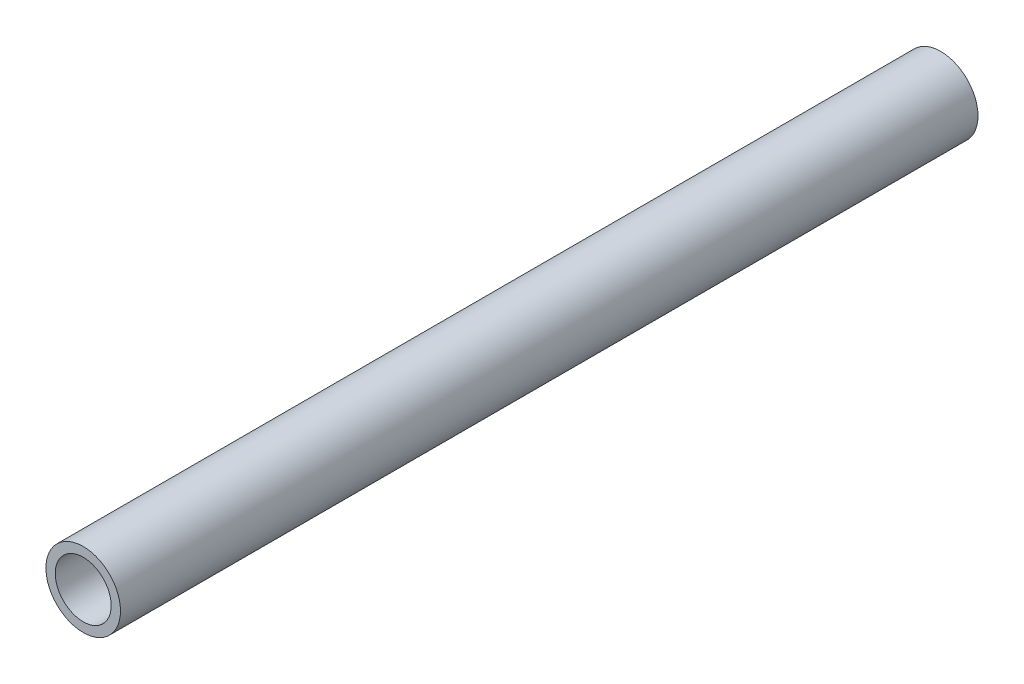
ISO-10303-21;
HEADER;
FILE_DESCRIPTION(('STEP AP214'),'2;1');
FILE_NAME('part.step','',(''),(''),'','','');
FILE_SCHEMA(('AUTOMOTIVE_DESIGN { 1 0 10303 214 1 1 1 1 }'));
ENDSEC;
DATA;
#1=APPLICATION_CONTEXT('core data for automotive mechanical design processes');
#2=APPLICATION_PROTOCOL_DEFINITION('international standard','automotive_design',2000,#1);
#3=PRODUCT_CONTEXT('',#1,'mechanical');
#4=PRODUCT('Part','Part','',(#3));
#5=PRODUCT_RELATED_PRODUCT_CATEGORY('part','',(#4));
#6=PRODUCT_DEFINITION_FORMATION('','',#4);
#7=PRODUCT_DEFINITION_CONTEXT('part definition',#1,'design');
#8=PRODUCT_DEFINITION('design','',#6,#7);
#9=PRODUCT_DEFINITION_SHAPE('','',#8);
#10=(LENGTH_UNIT() NAMED_UNIT(*) SI_UNIT(.MILLI.,.METRE.));
#11=(NAMED_UNIT(*) PLANE_ANGLE_UNIT() SI_UNIT($,.RADIAN.));
#12=(NAMED_UNIT(*) SI_UNIT($,.STERADIAN.) SOLID_ANGLE_UNIT());
#13=UNCERTAINTY_MEASURE_WITH_UNIT(LENGTH_MEASURE(1.E-05),#10,'distance_accuracy_value','');
#14=(GEOMETRIC_REPRESENTATION_CONTEXT(3) GLOBAL_UNCERTAINTY_ASSIGNED_CONTEXT((#13)) GLOBAL_UNIT_ASSIGNED_CONTEXT((#10,
#11,#12)) REPRESENTATION_CONTEXT('',''));
#15=CARTESIAN_POINT('',(0.,0.,0.));
#16=DIRECTION('',(0.,0.,1.));
#17=DIRECTION('',(1.,0.,0.));
#18=AXIS2_PLACEMENT_3D('',#15,#16,#17);
#19=CARTESIAN_POINT('',(0.,0.,292.1));
#20=DIRECTION('',(0.,0.,1.));
#21=DIRECTION('',(1.,0.,0.));
#22=AXIS2_PLACEMENT_3D('',#19,#20,#21);
#23=PLANE('',#22);
#24=CARTESIAN_POINT('',(0.,0.,292.1));
#25=DIRECTION('',(0.,0.,1.));
#26=DIRECTION('',(1.,0.,0.));
#27=AXIS2_PLACEMENT_3D('',#24,#25,#26);
#28=CIRCLE('',#27,12.7);
#29=CARTESIAN_POINT('',(12.7,0.,292.1));
#30=VERTEX_POINT('',#29);
#31=EDGE_CURVE('E10',#30,#30,#28,.T.);
#32=ORIENTED_EDGE('',*,*,#31,.T.);
#33=EDGE_LOOP('',(#32));
#34=FACE_BOUND('',#33,.T.);
#35=CARTESIAN_POINT('',(0.,0.,292.1));
#36=DIRECTION('',(0.,0.,1.));
#37=DIRECTION('',(1.,0.,0.));
#38=AXIS2_PLACEMENT_3D('',#35,#36,#37);
#39=CIRCLE('',#38,9.525);
#40=CARTESIAN_POINT('',(9.525,0.,292.1));
#41=VERTEX_POINT('',#40);
#42=EDGE_CURVE('E46',#41,#41,#39,.T.);
#43=ORIENTED_EDGE('',*,*,#42,.F.);
#44=EDGE_LOOP('',(#43));
#45=FACE_BOUND('',#44,.T.);
#46=ADVANCED_FACE('F35',(#34,#45),#23,.T.);
#47=CARTESIAN_POINT('',(0.,0.,0.));
#48=DIRECTION('',(0.,0.,1.));
#49=DIRECTION('',(1.,0.,0.));
#50=AXIS2_PLACEMENT_3D('',#47,#48,#49);
#51=PLANE('',#50);
#52=CARTESIAN_POINT('',(0.,0.,0.));
#53=DIRECTION('',(0.,0.,1.));
#54=DIRECTION('',(1.,0.,0.));
#55=AXIS2_PLACEMENT_3D('',#52,#53,#54);
#56=CIRCLE('',#55,12.7);
#57=CARTESIAN_POINT('',(12.7,0.,0.));
#58=VERTEX_POINT('',#57);
#59=EDGE_CURVE('E39',#58,#58,#56,.T.);
#60=ORIENTED_EDGE('',*,*,#59,.F.);
#61=EDGE_LOOP('',(#60));
#62=FACE_BOUND('',#61,.T.);
#63=CARTESIAN_POINT('',(0.,0.,0.));
#64=DIRECTION('',(0.,0.,1.));
#65=DIRECTION('',(1.,0.,0.));
#66=AXIS2_PLACEMENT_3D('',#63,#64,#65);
#67=CIRCLE('',#66,9.525);
#68=CARTESIAN_POINT('',(9.525,0.,0.));
#69=VERTEX_POINT('',#68);
#70=EDGE_CURVE('E48',#69,#69,#67,.T.);
#71=ORIENTED_EDGE('',*,*,#70,.T.);
#72=EDGE_LOOP('',(#71));
#73=FACE_BOUND('',#72,.T.);
#74=ADVANCED_FACE('F58',(#62,#73),#51,.F.);
#75=CARTESIAN_POINT('',(0.,0.,292.1));
#76=DIRECTION('',(0.,0.,-1.));
#77=DIRECTION('',(-1.,0.,0.));
#78=AXIS2_PLACEMENT_3D('',#75,#76,#77);
#79=CYLINDRICAL_SURFACE('',#78,12.7);
#80=ORIENTED_EDGE('',*,*,#31,.F.);
#81=EDGE_LOOP('',(#80));
#82=FACE_BOUND('',#81,.T.);
#83=ORIENTED_EDGE('',*,*,#59,.T.);
#84=EDGE_LOOP('',(#83));
#85=FACE_BOUND('',#84,.T.);
#86=ADVANCED_FACE('F37',(#82,#85),#79,.T.);
#87=CARTESIAN_POINT('',(0.,0.,292.1));
#88=DIRECTION('',(0.,0.,-1.));
#89=DIRECTION('',(-1.,0.,0.));
#90=AXIS2_PLACEMENT_3D('',#87,#88,#89);
#91=CYLINDRICAL_SURFACE('',#90,9.525);
#92=ORIENTED_EDGE('',*,*,#42,.T.);
#93=EDGE_LOOP('',(#92));
#94=FACE_BOUND('',#93,.T.);
#95=ORIENTED_EDGE('',*,*,#70,.F.);
#96=EDGE_LOOP('',(#95));
#97=FACE_BOUND('',#96,.T.);
#98=ADVANCED_FACE('F54',(#94,#97),#91,.F.);
#99=CLOSED_SHELL('',(#46,#74,#86,#98));
#100=MANIFOLD_SOLID_BREP('B2',#99);
#101=ADVANCED_BREP_SHAPE_REPRESENTATION('',(#18,#100),#14);
#102=SHAPE_DEFINITION_REPRESENTATION(#9,#101);
ENDSEC;
END-ISO-10303-21;
